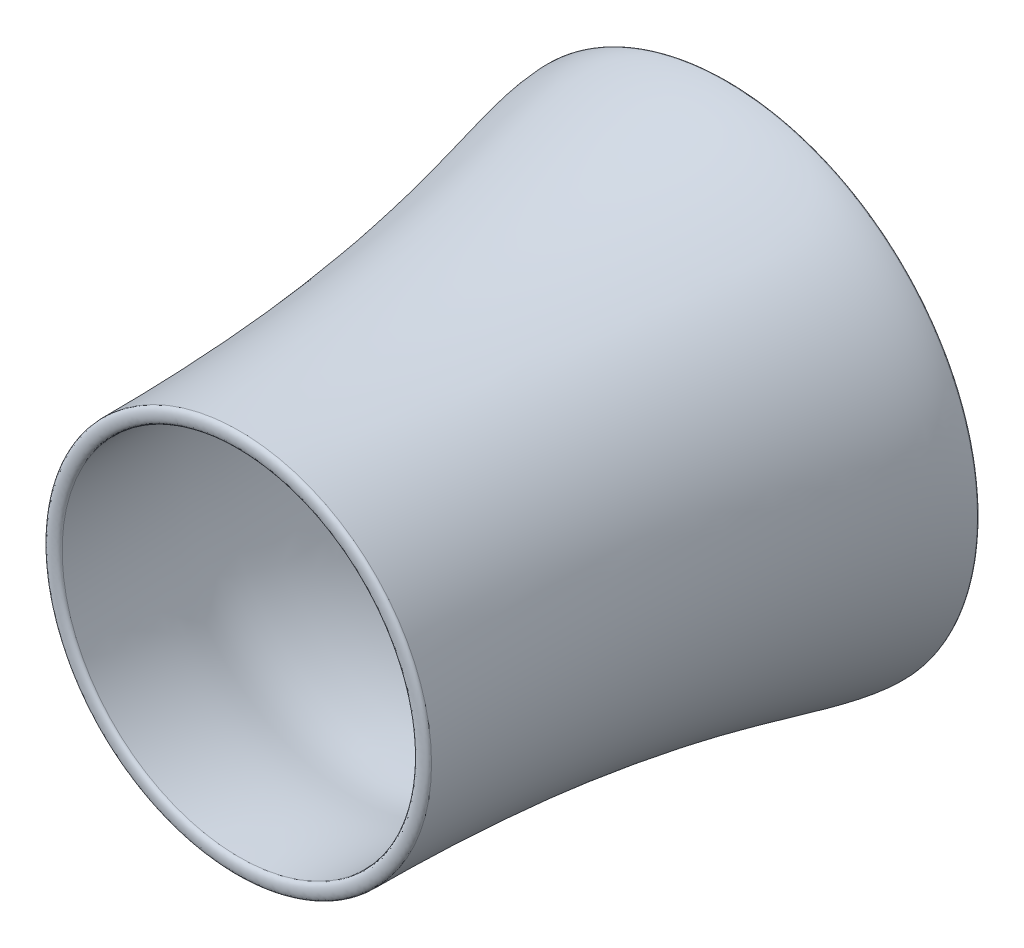
ISO-10303-21;
HEADER;
FILE_DESCRIPTION(('STEP AP214'),'2;1');
FILE_NAME('part.step','',(''),(''),'','','');
FILE_SCHEMA(('AUTOMOTIVE_DESIGN { 1 0 10303 214 1 1 1 1 }'));
ENDSEC;
DATA;
#1=APPLICATION_CONTEXT('core data for automotive mechanical design processes');
#2=APPLICATION_PROTOCOL_DEFINITION('international standard','automotive_design',2000,#1);
#3=PRODUCT_CONTEXT('',#1,'mechanical');
#4=PRODUCT('Part','Part','',(#3));
#5=PRODUCT_RELATED_PRODUCT_CATEGORY('part','',(#4));
#6=PRODUCT_DEFINITION_FORMATION('','',#4);
#7=PRODUCT_DEFINITION_CONTEXT('part definition',#1,'design');
#8=PRODUCT_DEFINITION('design','',#6,#7);
#9=PRODUCT_DEFINITION_SHAPE('','',#8);
#10=(LENGTH_UNIT() NAMED_UNIT(*) SI_UNIT(.MILLI.,.METRE.));
#11=(NAMED_UNIT(*) PLANE_ANGLE_UNIT() SI_UNIT($,.RADIAN.));
#12=(NAMED_UNIT(*) SI_UNIT($,.STERADIAN.) SOLID_ANGLE_UNIT());
#13=UNCERTAINTY_MEASURE_WITH_UNIT(LENGTH_MEASURE(1.E-05),#10,'distance_accuracy_value','');
#14=(GEOMETRIC_REPRESENTATION_CONTEXT(3) GLOBAL_UNCERTAINTY_ASSIGNED_CONTEXT((#13)) GLOBAL_UNIT_ASSIGNED_CONTEXT((#10,
#11,#12)) REPRESENTATION_CONTEXT('',''));
#15=CARTESIAN_POINT('',(0.,0.,0.));
#16=DIRECTION('',(0.,0.,1.));
#17=DIRECTION('',(1.,0.,0.));
#18=AXIS2_PLACEMENT_3D('',#15,#16,#17);
#19=CARTESIAN_POINT('',(-450.143329298044,0.,1171.92999551442));
#20=CARTESIAN_POINT('',(-450.143329298044,0.,1184.62999551442));
#21=CARTESIAN_POINT('',(-415.046918133656,0.,1184.62999551442));
#22=CARTESIAN_POINT('',(-415.046918133656,0.,1171.92999551442));
#23=B_SPLINE_CURVE_WITH_KNOTS('',3,(#19,#20,#21,#22),.UNSPECIFIED.,.F.,.F.,(4,4),(0.,1.),.UNSPECIFIED.);
#24=CARTESIAN_POINT('',(0.,0.,1104.75683012291));
#25=DIRECTION('',(0.,0.,1.));
#26=AXIS1_PLACEMENT('',#24,#25);
#27=SURFACE_OF_REVOLUTION('',#23,#26);
#28=CARTESIAN_POINT('',(0.,0.,1171.92999551442));
#29=DIRECTION('',(0.,0.,1.));
#30=DIRECTION('',(1.,0.,0.));
#31=AXIS2_PLACEMENT_3D('',#28,#29,#30);
#32=CIRCLE('',#31,415.046918133656);
#33=CARTESIAN_POINT('',(415.046918133656,0.,1171.92999551442));
#34=VERTEX_POINT('',#33);
#35=EDGE_CURVE('E47',#34,#34,#32,.T.);
#36=ORIENTED_EDGE('',*,*,#35,.F.);
#37=EDGE_LOOP('',(#36));
#38=FACE_BOUND('',#37,.T.);
#39=CARTESIAN_POINT('',(0.,0.,1171.92999551442));
#40=DIRECTION('',(0.,0.,1.));
#41=DIRECTION('',(1.,0.,0.));
#42=AXIS2_PLACEMENT_3D('',#39,#40,#41);
#43=CIRCLE('',#42,450.143329298044);
#44=CARTESIAN_POINT('',(450.143329298044,0.,1171.92999551442));
#45=VERTEX_POINT('',#44);
#46=EDGE_CURVE('E11',#45,#45,#43,.T.);
#47=ORIENTED_EDGE('',*,*,#46,.T.);
#48=EDGE_LOOP('',(#47));
#49=FACE_BOUND('',#48,.T.);
#50=ADVANCED_FACE('F40',(#38,#49),#27,.T.);
#51=CARTESIAN_POINT('',(-450.143329298044,0.,1171.92999551442));
#52=DIRECTION('',(0.,0.,1.));
#53=DIRECTION('',(1.,0.,0.));
#54=AXIS2_PLACEMENT_3D('',#51,#52,#53);
#55=PLANE('',#54);
#56=ORIENTED_EDGE('',*,*,#46,.F.);
#57=EDGE_LOOP('',(#56));
#58=FACE_BOUND('',#57,.T.);
#59=ORIENTED_EDGE('',*,*,#35,.T.);
#60=EDGE_LOOP('',(#59));
#61=FACE_BOUND('',#60,.T.);
#62=ADVANCED_FACE('F59',(#58,#61),#55,.F.);
#63=CLOSED_SHELL('',(#50,#62));
#64=MANIFOLD_SOLID_BREP('B2',#63);
#65=CARTESIAN_POINT('',(-422.199759508197,0.,32.243936504091));
#66=CARTESIAN_POINT('',(-422.199759508197,0.,15.3106031707575));
#67=CARTESIAN_POINT('',(-589.099391580839,0.,15.3106031707576));
#68=CARTESIAN_POINT('',(-589.099391580839,0.,32.243936504091));
#69=B_SPLINE_CURVE_WITH_KNOTS('',3,(#65,#66,#67,#68),.UNSPECIFIED.,.F.,.F.,(4,4),(0.,1.),.UNSPECIFIED.);
#70=CARTESIAN_POINT('',(0.,0.,99.6847843209707));
#71=DIRECTION('',(0.,0.,1.));
#72=AXIS1_PLACEMENT('',#70,#71);
#73=SURFACE_OF_REVOLUTION('',#69,#72);
#74=CARTESIAN_POINT('',(0.,0.,32.243936504091));
#75=DIRECTION('',(0.,0.,1.));
#76=DIRECTION('',(1.,0.,0.));
#77=AXIS2_PLACEMENT_3D('',#74,#75,#76);
#78=CIRCLE('',#77,589.099391580839);
#79=CARTESIAN_POINT('',(589.099391580839,0.,32.243936504091));
#80=VERTEX_POINT('',#79);
#81=EDGE_CURVE('E39',#80,#80,#78,.T.);
#82=ORIENTED_EDGE('',*,*,#81,.F.);
#83=EDGE_LOOP('',(#82));
#84=FACE_BOUND('',#83,.T.);
#85=CARTESIAN_POINT('',(0.,0.,32.243936504091));
#86=DIRECTION('',(0.,0.,1.));
#87=DIRECTION('',(1.,0.,0.));
#88=AXIS2_PLACEMENT_3D('',#85,#86,#87);
#89=CIRCLE('',#88,422.199759508197);
#90=CARTESIAN_POINT('',(422.199759508197,0.,32.243936504091));
#91=VERTEX_POINT('',#90);
#92=EDGE_CURVE('E93',#91,#91,#89,.T.);
#93=ORIENTED_EDGE('',*,*,#92,.T.);
#94=EDGE_LOOP('',(#93));
#95=FACE_BOUND('',#94,.T.);
#96=ADVANCED_FACE('F86',(#84,#95),#73,.T.);
#97=CARTESIAN_POINT('',(-589.099391580839,0.,32.243936504091));
#98=DIRECTION('',(0.,0.,-1.));
#99=DIRECTION('',(-1.,0.,0.));
#100=AXIS2_PLACEMENT_3D('',#97,#98,#99);
#101=PLANE('',#100);
#102=ORIENTED_EDGE('',*,*,#92,.F.);
#103=EDGE_LOOP('',(#102));
#104=FACE_BOUND('',#103,.T.);
#105=ORIENTED_EDGE('',*,*,#81,.T.);
#106=EDGE_LOOP('',(#105));
#107=FACE_BOUND('',#106,.T.);
#108=ADVANCED_FACE('F106',(#104,#107),#101,.F.);
#109=CLOSED_SHELL('',(#96,#108));
#110=MANIFOLD_SOLID_BREP('B6',#109);
#111=CARTESIAN_POINT('',(-415.046918133656,0.,1171.92999551442));
#112=CARTESIAN_POINT('',(-415.046918133664,0.,882.821374874493));
#113=CARTESIAN_POINT('',(-443.486134021643,0.,959.839083612043));
#114=CARTESIAN_POINT('',(-428.719828510863,0.,617.113742102313));
#115=CARTESIAN_POINT('',(-496.283010682899,0.,391.324653200704));
#116=CARTESIAN_POINT('',(-422.199759508197,0.,84.8796890261045));
#117=CARTESIAN_POINT('',(-422.199759508197,0.,32.2439365040909));
#118=B_SPLINE_CURVE_WITH_KNOTS('',3,(#111,#112,#113,#114,#115,#116,#117),.UNSPECIFIED.,.F.,.F.,
(4,1,1,1,4),(0.,0.515022649097204,0.793493092504956,0.841990827595236,1.),.UNSPECIFIED.);
#119=CARTESIAN_POINT('',(0.,0.,99.6847843209707));
#120=DIRECTION('',(0.,0.,1.));
#121=AXIS1_PLACEMENT('',#119,#120);
#122=SURFACE_OF_REVOLUTION('',#118,#121);
#123=CARTESIAN_POINT('',(0.,0.,32.2439365040909));
#124=DIRECTION('',(0.,0.,1.));
#125=DIRECTION('',(1.,0.,0.));
#126=AXIS2_PLACEMENT_3D('',#123,#124,#125);
#127=CIRCLE('',#126,422.199759508197);
#128=CARTESIAN_POINT('',(422.199759508197,0.,32.2439365040909));
#129=VERTEX_POINT('',#128);
#130=EDGE_CURVE('E85',#129,#129,#127,.T.);
#131=ORIENTED_EDGE('',*,*,#130,.F.);
#132=EDGE_LOOP('',(#131));
#133=FACE_BOUND('',#132,.T.);
#134=CARTESIAN_POINT('',(0.,0.,1171.92999551442));
#135=DIRECTION('',(0.,0.,1.));
#136=DIRECTION('',(1.,0.,0.));
#137=AXIS2_PLACEMENT_3D('',#134,#135,#136);
#138=CIRCLE('',#137,415.046918133656);
#139=CARTESIAN_POINT('',(415.046918133656,0.,1171.92999551442));
#140=VERTEX_POINT('',#139);
#141=EDGE_CURVE('E140',#140,#140,#138,.T.);
#142=ORIENTED_EDGE('',*,*,#141,.T.);
#143=EDGE_LOOP('',(#142));
#144=FACE_BOUND('',#143,.T.);
#145=ADVANCED_FACE('F125',(#133,#144),#122,.T.);
#146=CARTESIAN_POINT('',(-422.199759508197,0.,32.243936504091));
#147=DIRECTION('',(0.,0.,1.));
#148=DIRECTION('',(1.,0.,0.));
#149=AXIS2_PLACEMENT_3D('',#146,#147,#148);
#150=PLANE('',#149);
#151=CARTESIAN_POINT('',(0.,0.,32.243936504091));
#152=DIRECTION('',(0.,0.,1.));
#153=DIRECTION('',(1.,0.,0.));
#154=AXIS2_PLACEMENT_3D('',#151,#152,#153);
#155=CIRCLE('',#154,589.099391580839);
#156=CARTESIAN_POINT('',(589.099391580839,0.,32.243936504091));
#157=VERTEX_POINT('',#156);
#158=EDGE_CURVE('E132',#157,#157,#155,.T.);
#159=ORIENTED_EDGE('',*,*,#158,.F.);
#160=EDGE_LOOP('',(#159));
#161=FACE_BOUND('',#160,.T.);
#162=ORIENTED_EDGE('',*,*,#130,.T.);
#163=EDGE_LOOP('',(#162));
#164=FACE_BOUND('',#163,.T.);
#165=ADVANCED_FACE('F159',(#161,#164),#150,.F.);
#166=CARTESIAN_POINT('',(-589.099391580839,0.,32.243936504091));
#167=CARTESIAN_POINT('',(-589.099391580839,0.,157.627888880383));
#168=CARTESIAN_POINT('',(-450.143329298044,0.,441.620875129163));
#169=CARTESIAN_POINT('',(-450.143329298044,0.,1171.92999551442));
#170=B_SPLINE_CURVE_WITH_KNOTS('',3,(#166,#167,#168,#169),.UNSPECIFIED.,.F.,.F.,(4,4),(0.,1.),.UNSPECIFIED.);
#171=CARTESIAN_POINT('',(0.,0.,99.6847843209707));
#172=DIRECTION('',(0.,0.,1.));
#173=AXIS1_PLACEMENT('',#171,#172);
#174=SURFACE_OF_REVOLUTION('',#170,#173);
#175=CARTESIAN_POINT('',(0.,0.,1171.92999551442));
#176=DIRECTION('',(0.,0.,1.));
#177=DIRECTION('',(1.,0.,0.));
#178=AXIS2_PLACEMENT_3D('',#175,#176,#177);
#179=CIRCLE('',#178,450.143329298044);
#180=CARTESIAN_POINT('',(450.143329298044,0.,1171.92999551442));
#181=VERTEX_POINT('',#180);
#182=EDGE_CURVE('E136',#181,#181,#179,.T.);
#183=ORIENTED_EDGE('',*,*,#182,.F.);
#184=EDGE_LOOP('',(#183));
#185=FACE_BOUND('',#184,.T.);
#186=ORIENTED_EDGE('',*,*,#158,.T.);
#187=EDGE_LOOP('',(#186));
#188=FACE_BOUND('',#187,.T.);
#189=ADVANCED_FACE('F155',(#185,#188),#174,.T.);
#190=CARTESIAN_POINT('',(-415.046918133656,0.,1171.92999551442));
#191=DIRECTION('',(0.,0.,-1.));
#192=DIRECTION('',(-1.,0.,0.));
#193=AXIS2_PLACEMENT_3D('',#190,#191,#192);
#194=PLANE('',#193);
#195=ORIENTED_EDGE('',*,*,#141,.F.);
#196=EDGE_LOOP('',(#195));
#197=FACE_BOUND('',#196,.T.);
#198=ORIENTED_EDGE('',*,*,#182,.T.);
#199=EDGE_LOOP('',(#198));
#200=FACE_BOUND('',#199,.T.);
#201=ADVANCED_FACE('F158',(#197,#200),#194,.F.);
#202=CLOSED_SHELL('',(#145,#165,#189,#201));
#203=MANIFOLD_SOLID_BREP('B34',#202);
#204=ADVANCED_BREP_SHAPE_REPRESENTATION('',(#18,#64,#110,#203),#14);
#205=SHAPE_DEFINITION_REPRESENTATION(#9,#204);
ENDSEC;
END-ISO-10303-21;
